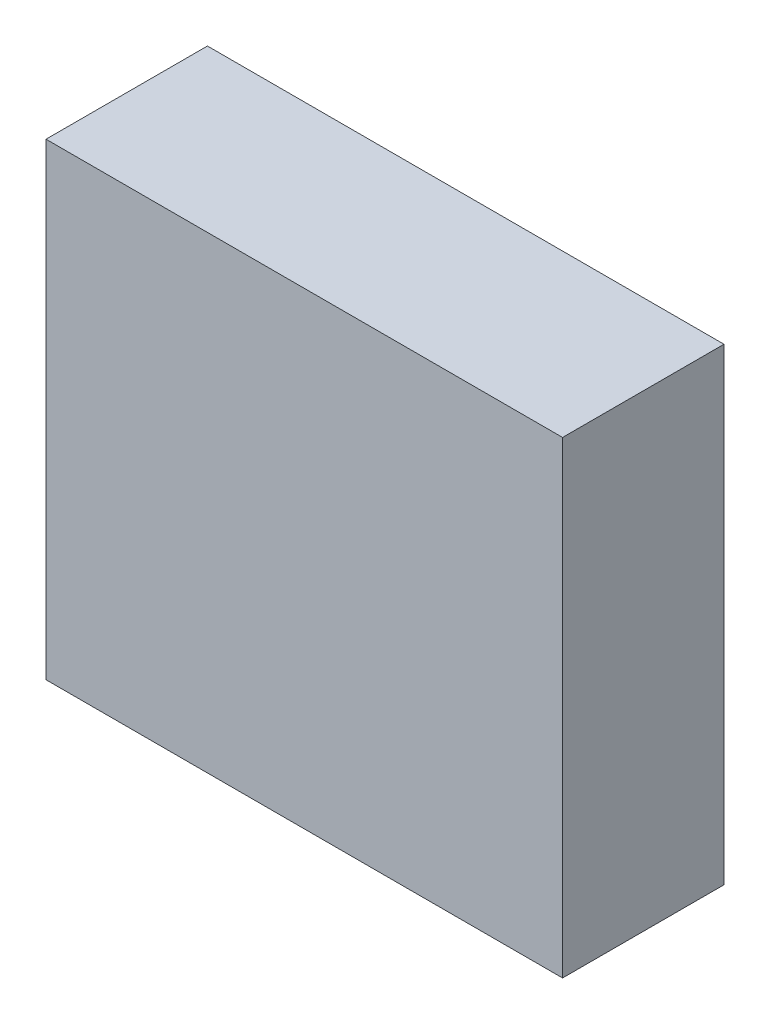
ISO-10303-21;
HEADER;
FILE_DESCRIPTION(('STEP AP214'),'2;1');
FILE_NAME('part.step','',(''),(''),'','','');
FILE_SCHEMA(('AUTOMOTIVE_DESIGN { 1 0 10303 214 1 1 1 1 }'));
ENDSEC;
DATA;
#1=APPLICATION_CONTEXT('core data for automotive mechanical design processes');
#2=APPLICATION_PROTOCOL_DEFINITION('international standard','automotive_design',2000,#1);
#3=PRODUCT_CONTEXT('',#1,'mechanical');
#4=PRODUCT('Part','Part','',(#3));
#5=PRODUCT_RELATED_PRODUCT_CATEGORY('part','',(#4));
#6=PRODUCT_DEFINITION_FORMATION('','',#4);
#7=PRODUCT_DEFINITION_CONTEXT('part definition',#1,'design');
#8=PRODUCT_DEFINITION('design','',#6,#7);
#9=PRODUCT_DEFINITION_SHAPE('','',#8);
#10=(LENGTH_UNIT() NAMED_UNIT(*) SI_UNIT(.MILLI.,.METRE.));
#11=(NAMED_UNIT(*) PLANE_ANGLE_UNIT() SI_UNIT($,.RADIAN.));
#12=(NAMED_UNIT(*) SI_UNIT($,.STERADIAN.) SOLID_ANGLE_UNIT());
#13=UNCERTAINTY_MEASURE_WITH_UNIT(LENGTH_MEASURE(1.E-05),#10,'distance_accuracy_value','');
#14=(GEOMETRIC_REPRESENTATION_CONTEXT(3) GLOBAL_UNCERTAINTY_ASSIGNED_CONTEXT((#13)) GLOBAL_UNIT_ASSIGNED_CONTEXT((#10,
#11,#12)) REPRESENTATION_CONTEXT('',''));
#15=CARTESIAN_POINT('',(0.,0.,0.));
#16=DIRECTION('',(0.,0.,1.));
#17=DIRECTION('',(1.,0.,0.));
#18=AXIS2_PLACEMENT_3D('',#15,#16,#17);
#19=CARTESIAN_POINT('',(-0.799998172238418,-0.725004661941568,-2.64111989736557));
#20=DIRECTION('',(-8.74227765734759E-08,-1.,0.));
#21=DIRECTION('',(1.,-8.74227765734759E-08,0.));
#22=AXIS2_PLACEMENT_3D('',#19,#20,#21);
#23=PLANE('',#22);
#24=DIRECTION('',(0.999999999999996,-8.74227765507069E-08,0.));
#25=VECTOR('',#24,1.);
#26=CARTESIAN_POINT('',(-0.799998172238418,-0.725004661941568,-2.64111989736557));
#27=LINE('',#26,#25);
#28=CARTESIAN_POINT('',(-0.799998172238418,-0.725004661941568,-2.64111989736557));
#29=VERTEX_POINT('',#28);
#30=CARTESIAN_POINT('',(0.799977413699082,-0.725004801815871,-2.64111989736557));
#31=VERTEX_POINT('',#30);
#32=EDGE_CURVE('E11',#29,#31,#27,.T.);
#33=ORIENTED_EDGE('',*,*,#32,.T.);
#34=DIRECTION('',(0.,0.,1.));
#35=VECTOR('',#34,1.);
#36=CARTESIAN_POINT('',(0.799977413699082,-0.725004801815877,-2.64111989736557));
#37=LINE('',#36,#35);
#38=CARTESIAN_POINT('',(0.799977413699082,-0.725004801815871,-2.14112091064453));
#39=VERTEX_POINT('',#38);
#40=EDGE_CURVE('E88',#31,#39,#37,.T.);
#41=ORIENTED_EDGE('',*,*,#40,.T.);
#42=DIRECTION('',(0.999999999999996,-8.74227765507069E-08,0.));
#43=VECTOR('',#42,1.);
#44=CARTESIAN_POINT('',(-0.799998172238418,-0.725004661941568,-2.14112091064453));
#45=LINE('',#44,#43);
#46=CARTESIAN_POINT('',(-0.799998172238418,-0.725004661941568,-2.14112091064453));
#47=VERTEX_POINT('',#46);
#48=EDGE_CURVE('E83',#47,#39,#45,.T.);
#49=ORIENTED_EDGE('',*,*,#48,.F.);
#50=DIRECTION('',(0.,0.,1.));
#51=VECTOR('',#50,1.);
#52=CARTESIAN_POINT('',(-0.799998172238405,-0.725004661941568,-2.64111989736557));
#53=LINE('',#52,#51);
#54=EDGE_CURVE('E72',#29,#47,#53,.T.);
#55=ORIENTED_EDGE('',*,*,#54,.F.);
#56=EDGE_LOOP('',(#33,#41,#49,#55));
#57=FACE_BOUND('',#56,.T.);
#58=ADVANCED_FACE('F17',(#57),#23,.T.);
#59=CARTESIAN_POINT('',(0.799977413699082,-0.725004801815871,-2.64111989736557));
#60=DIRECTION('',(1.,-8.74227765734759E-08,0.));
#61=DIRECTION('',(8.74227765734759E-08,1.,0.));
#62=AXIS2_PLACEMENT_3D('',#59,#60,#61);
#63=PLANE('',#62);
#64=DIRECTION('',(8.74227765590445E-08,0.999999999999996,0.));
#65=VECTOR('',#64,1.);
#66=CARTESIAN_POINT('',(0.799977413699082,-0.725004801815871,-2.64111989736557));
#67=LINE('',#66,#65);
#68=CARTESIAN_POINT('',(0.799977540462521,0.724999775820848,-2.64111989736557));
#69=VERTEX_POINT('',#68);
#70=EDGE_CURVE('E24',#31,#69,#67,.T.);
#71=ORIENTED_EDGE('',*,*,#70,.T.);
#72=DIRECTION('',(0.,0.,1.));
#73=VECTOR('',#72,1.);
#74=CARTESIAN_POINT('',(0.799977540462509,0.724999775820848,-2.64111989736557));
#75=LINE('',#74,#73);
#76=CARTESIAN_POINT('',(0.799977540462521,0.724999775820848,-2.14112091064453));
#77=VERTEX_POINT('',#76);
#78=EDGE_CURVE('E85',#69,#77,#75,.T.);
#79=ORIENTED_EDGE('',*,*,#78,.T.);
#80=DIRECTION('',(8.74227765590445E-08,0.999999999999996,0.));
#81=VECTOR('',#80,1.);
#82=CARTESIAN_POINT('',(0.799977413699082,-0.725004801815871,-2.14112091064453));
#83=LINE('',#82,#81);
#84=EDGE_CURVE('E66',#39,#77,#83,.T.);
#85=ORIENTED_EDGE('',*,*,#84,.F.);
#86=ORIENTED_EDGE('',*,*,#40,.F.);
#87=EDGE_LOOP('',(#71,#79,#85,#86));
#88=FACE_BOUND('',#87,.T.);
#89=ADVANCED_FACE('F89',(#88),#63,.T.);
#90=CARTESIAN_POINT('',(0.799977540462521,0.724999775820848,-2.64111989736557));
#91=DIRECTION('',(8.74227765734759E-08,1.,0.));
#92=DIRECTION('',(-1.,8.74227765734759E-08,0.));
#93=AXIS2_PLACEMENT_3D('',#90,#91,#92);
#94=PLANE('',#93);
#95=DIRECTION('',(-0.999999999999996,8.74227765507069E-08,0.));
#96=VECTOR('',#95,1.);
#97=CARTESIAN_POINT('',(0.799977540462521,0.724999775820848,-2.64111989736557));
#98=LINE('',#97,#96);
#99=CARTESIAN_POINT('',(-0.799998045474979,0.72499991569515,-2.64111989736557));
#100=VERTEX_POINT('',#99);
#101=EDGE_CURVE('E62',#69,#100,#98,.T.);
#102=ORIENTED_EDGE('',*,*,#101,.T.);
#103=DIRECTION('',(0.,0.,1.));
#104=VECTOR('',#103,1.);
#105=CARTESIAN_POINT('',(-0.799998045474979,0.724999915695156,-2.64111989736557));
#106=LINE('',#105,#104);
#107=CARTESIAN_POINT('',(-0.799998045474979,0.72499991569515,-2.14112091064453));
#108=VERTEX_POINT('',#107);
#109=EDGE_CURVE('E55',#100,#108,#106,.T.);
#110=ORIENTED_EDGE('',*,*,#109,.T.);
#111=DIRECTION('',(-0.999999999999996,8.74227765507069E-08,0.));
#112=VECTOR('',#111,1.);
#113=CARTESIAN_POINT('',(0.799977540462521,0.724999775820848,-2.14112091064453));
#114=LINE('',#113,#112);
#115=EDGE_CURVE('E59',#77,#108,#114,.T.);
#116=ORIENTED_EDGE('',*,*,#115,.F.);
#117=ORIENTED_EDGE('',*,*,#78,.F.);
#118=EDGE_LOOP('',(#102,#110,#116,#117));
#119=FACE_BOUND('',#118,.T.);
#120=ADVANCED_FACE('F57',(#119),#94,.T.);
#121=CARTESIAN_POINT('',(-0.799998045474979,0.72499991569515,-2.64111989736557));
#122=DIRECTION('',(-1.,8.74227765734759E-08,0.));
#123=DIRECTION('',(-8.74227765734759E-08,-1.,0.));
#124=AXIS2_PLACEMENT_3D('',#121,#122,#123);
#125=PLANE('',#124);
#126=DIRECTION('',(-8.74227765590445E-08,-0.999999999999996,0.));
#127=VECTOR('',#126,1.);
#128=CARTESIAN_POINT('',(-0.799998045474979,0.72499991569515,-2.64111989736557));
#129=LINE('',#128,#127);
#130=EDGE_CURVE('E65',#100,#29,#129,.T.);
#131=ORIENTED_EDGE('',*,*,#130,.T.);
#132=ORIENTED_EDGE('',*,*,#54,.T.);
#133=DIRECTION('',(-8.74227765590445E-08,-0.999999999999996,0.));
#134=VECTOR('',#133,1.);
#135=CARTESIAN_POINT('',(-0.799998045474979,0.72499991569515,-2.14112091064453));
#136=LINE('',#135,#134);
#137=EDGE_CURVE('E70',#108,#47,#136,.T.);
#138=ORIENTED_EDGE('',*,*,#137,.F.);
#139=ORIENTED_EDGE('',*,*,#109,.F.);
#140=EDGE_LOOP('',(#131,#132,#138,#139));
#141=FACE_BOUND('',#140,.T.);
#142=ADVANCED_FACE('F71',(#141),#125,.T.);
#143=CARTESIAN_POINT('',(277.5,117.999977111816,-2.14112091064453));
#144=DIRECTION('',(0.,0.,1.));
#145=DIRECTION('',(-1.,8.74227765734759E-08,0.));
#146=AXIS2_PLACEMENT_3D('',#143,#144,#145);
#147=PLANE('',#146);
#148=ORIENTED_EDGE('',*,*,#48,.T.);
#149=ORIENTED_EDGE('',*,*,#84,.T.);
#150=ORIENTED_EDGE('',*,*,#115,.T.);
#151=ORIENTED_EDGE('',*,*,#137,.T.);
#152=EDGE_LOOP('',(#148,#149,#150,#151));
#153=FACE_BOUND('',#152,.T.);
#154=ADVANCED_FACE('F76',(#153),#147,.T.);
#155=CARTESIAN_POINT('',(277.5,117.999977111816,-2.64111989736557));
#156=DIRECTION('',(0.,0.,1.));
#157=DIRECTION('',(-1.,8.74227765734759E-08,0.));
#158=AXIS2_PLACEMENT_3D('',#155,#156,#157);
#159=PLANE('',#158);
#160=ORIENTED_EDGE('',*,*,#130,.F.);
#161=ORIENTED_EDGE('',*,*,#101,.F.);
#162=ORIENTED_EDGE('',*,*,#70,.F.);
#163=ORIENTED_EDGE('',*,*,#32,.F.);
#164=EDGE_LOOP('',(#160,#161,#162,#163));
#165=FACE_BOUND('',#164,.T.);
#166=ADVANCED_FACE('F91',(#165),#159,.F.);
#167=CLOSED_SHELL('',(#58,#89,#120,#142,#154,#166));
#168=MANIFOLD_SOLID_BREP('B1',#167);
#169=ADVANCED_BREP_SHAPE_REPRESENTATION('',(#18,#168),#14);
#170=SHAPE_DEFINITION_REPRESENTATION(#9,#169);
ENDSEC;
END-ISO-10303-21;
